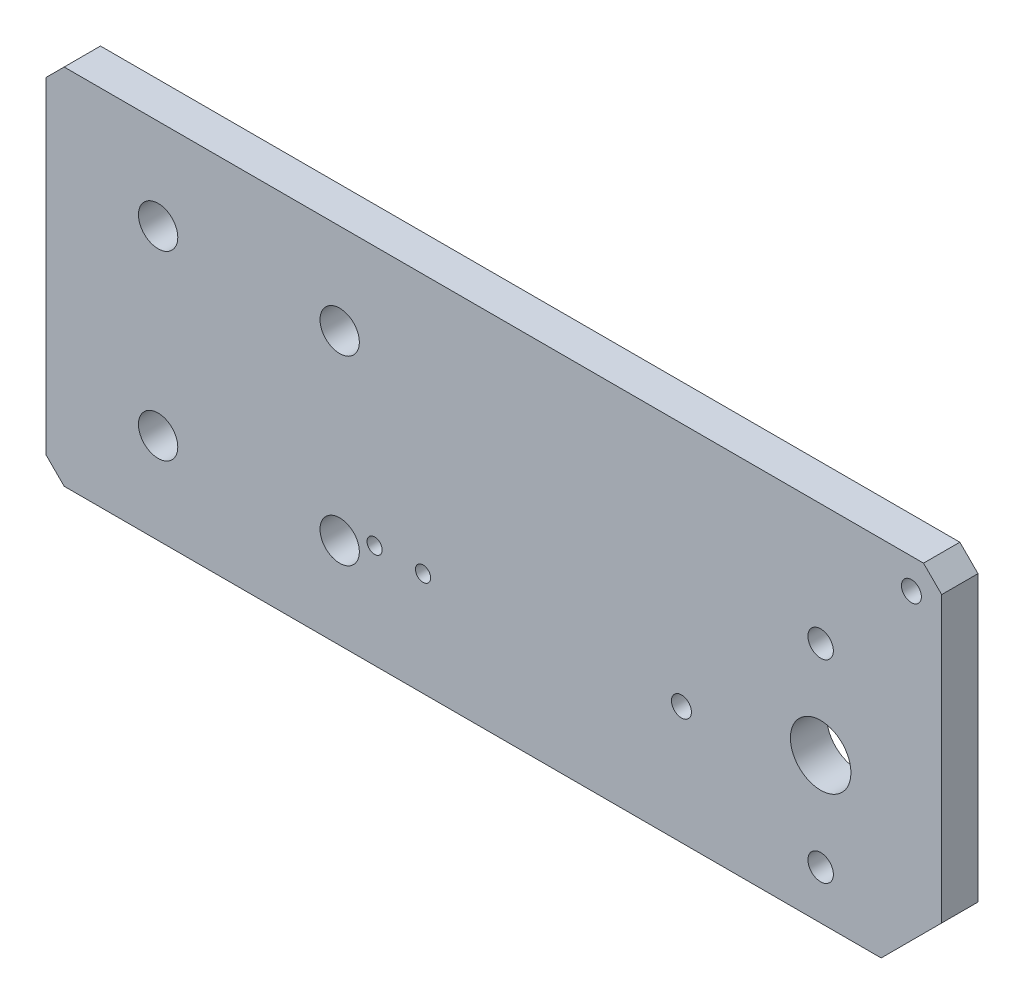
ISO-10303-21;
HEADER;
FILE_DESCRIPTION(('STEP AP214'),'2;1');
FILE_NAME('part.step','',(''),(''),'','','');
FILE_SCHEMA(('AUTOMOTIVE_DESIGN { 1 0 10303 214 1 1 1 1 }'));
ENDSEC;
DATA;
#1=APPLICATION_CONTEXT('core data for automotive mechanical design processes');
#2=APPLICATION_PROTOCOL_DEFINITION('international standard','automotive_design',2000,#1);
#3=PRODUCT_CONTEXT('',#1,'mechanical');
#4=PRODUCT('Part','Part','',(#3));
#5=PRODUCT_RELATED_PRODUCT_CATEGORY('part','',(#4));
#6=PRODUCT_DEFINITION_FORMATION('','',#4);
#7=PRODUCT_DEFINITION_CONTEXT('part definition',#1,'design');
#8=PRODUCT_DEFINITION('design','',#6,#7);
#9=PRODUCT_DEFINITION_SHAPE('','',#8);
#10=(LENGTH_UNIT() NAMED_UNIT(*) SI_UNIT(.MILLI.,.METRE.));
#11=(NAMED_UNIT(*) PLANE_ANGLE_UNIT() SI_UNIT($,.RADIAN.));
#12=(NAMED_UNIT(*) SI_UNIT($,.STERADIAN.) SOLID_ANGLE_UNIT());
#13=UNCERTAINTY_MEASURE_WITH_UNIT(LENGTH_MEASURE(1.E-05),#10,'distance_accuracy_value','');
#14=(GEOMETRIC_REPRESENTATION_CONTEXT(3) GLOBAL_UNCERTAINTY_ASSIGNED_CONTEXT((#13)) GLOBAL_UNIT_ASSIGNED_CONTEXT((#10,
#11,#12)) REPRESENTATION_CONTEXT('',''));
#15=CARTESIAN_POINT('',(0.,0.,0.));
#16=DIRECTION('',(0.,0.,1.));
#17=DIRECTION('',(1.,0.,0.));
#18=AXIS2_PLACEMENT_3D('',#15,#16,#17);
#19=CARTESIAN_POINT('',(0.,0.,6.));
#20=DIRECTION('',(0.,0.,1.));
#21=DIRECTION('',(1.,0.,0.));
#22=AXIS2_PLACEMENT_3D('',#19,#20,#21);
#23=PLANE('',#22);
#24=CARTESIAN_POINT('',(0.781223922114056,-15.4494436717663,6.));
#25=DIRECTION('',(0.,0.,1.));
#26=DIRECTION('',(1.,0.,0.));
#27=AXIS2_PLACEMENT_3D('',#24,#25,#26);
#28=CIRCLE('',#27,1.25);
#29=CARTESIAN_POINT('',(2.03122392211405,-15.4494436717663,6.));
#30=VERTEX_POINT('',#29);
#31=EDGE_CURVE('E232',#30,#30,#28,.T.);
#32=ORIENTED_EDGE('',*,*,#31,.F.);
#33=EDGE_LOOP('',(#32));
#34=FACE_BOUND('',#33,.T.);
#35=CARTESIAN_POINT('',(8.78122392211406,-15.4494436717663,6.));
#36=DIRECTION('',(0.,0.,1.));
#37=DIRECTION('',(1.,0.,0.));
#38=AXIS2_PLACEMENT_3D('',#35,#36,#37);
#39=CIRCLE('',#38,1.25);
#40=CARTESIAN_POINT('',(10.0312239221141,-15.4494436717663,6.));
#41=VERTEX_POINT('',#40);
#42=EDGE_CURVE('E226',#41,#41,#39,.T.);
#43=ORIENTED_EDGE('',*,*,#42,.F.);
#44=EDGE_LOOP('',(#43));
#45=FACE_BOUND('',#44,.T.);
#46=CARTESIAN_POINT('',(89.4812239221141,22.4005563282337,6.));
#47=DIRECTION('',(0.,0.,1.));
#48=DIRECTION('',(1.,0.,0.));
#49=AXIS2_PLACEMENT_3D('',#46,#47,#48);
#50=CIRCLE('',#49,1.65);
#51=CARTESIAN_POINT('',(91.131223922114,22.4005563282337,6.));
#52=VERTEX_POINT('',#51);
#53=EDGE_CURVE('E220',#52,#52,#50,.T.);
#54=ORIENTED_EDGE('',*,*,#53,.F.);
#55=EDGE_LOOP('',(#54));
#56=FACE_BOUND('',#55,.T.);
#57=CARTESIAN_POINT('',(51.4812239221141,-13.0994436717663,6.));
#58=DIRECTION('',(0.,0.,1.));
#59=DIRECTION('',(1.,0.,0.));
#60=AXIS2_PLACEMENT_3D('',#57,#58,#59);
#61=CIRCLE('',#60,1.65);
#62=CARTESIAN_POINT('',(53.1312239221141,-13.0994436717663,6.));
#63=VERTEX_POINT('',#62);
#64=EDGE_CURVE('E214',#63,#63,#61,.T.);
#65=ORIENTED_EDGE('',*,*,#64,.F.);
#66=EDGE_LOOP('',(#65));
#67=FACE_BOUND('',#66,.T.);
#68=CARTESIAN_POINT('',(74.4812239221141,7.40055632823366,6.));
#69=DIRECTION('',(0.,0.,1.));
#70=DIRECTION('',(1.,0.,0.));
#71=AXIS2_PLACEMENT_3D('',#68,#69,#70);
#72=CIRCLE('',#71,2.1);
#73=CARTESIAN_POINT('',(76.5812239221141,7.40055632823366,6.));
#74=VERTEX_POINT('',#73);
#75=EDGE_CURVE('E208',#74,#74,#72,.T.);
#76=ORIENTED_EDGE('',*,*,#75,.F.);
#77=EDGE_LOOP('',(#76));
#78=FACE_BOUND('',#77,.T.);
#79=CARTESIAN_POINT('',(74.4812239221141,-24.5994436717663,6.));
#80=DIRECTION('',(0.,0.,1.));
#81=DIRECTION('',(1.,0.,0.));
#82=AXIS2_PLACEMENT_3D('',#79,#80,#81);
#83=CIRCLE('',#82,2.1);
#84=CARTESIAN_POINT('',(76.5812239221141,-24.5994436717663,6.));
#85=VERTEX_POINT('',#84);
#86=EDGE_CURVE('E202',#85,#85,#83,.T.);
#87=ORIENTED_EDGE('',*,*,#86,.F.);
#88=EDGE_LOOP('',(#87));
#89=FACE_BOUND('',#88,.T.);
#90=CARTESIAN_POINT('',(-4.99304589707927,-17.5994436717663,6.));
#91=DIRECTION('',(0.,0.,1.));
#92=DIRECTION('',(1.,0.,0.));
#93=AXIS2_PLACEMENT_3D('',#90,#91,#92);
#94=CIRCLE('',#93,3.25);
#95=CARTESIAN_POINT('',(-1.74304589707927,-17.5994436717663,6.));
#96=VERTEX_POINT('',#95);
#97=EDGE_CURVE('E185',#96,#96,#94,.T.);
#98=ORIENTED_EDGE('',*,*,#97,.F.);
#99=EDGE_LOOP('',(#98));
#100=FACE_BOUND('',#99,.T.);
#101=CARTESIAN_POINT('',(-4.99304589707927,12.4005563282337,6.));
#102=DIRECTION('',(0.,0.,1.));
#103=DIRECTION('',(1.,0.,0.));
#104=AXIS2_PLACEMENT_3D('',#101,#102,#103);
#105=CIRCLE('',#104,3.25);
#106=CARTESIAN_POINT('',(-1.74304589707927,12.4005563282337,6.));
#107=VERTEX_POINT('',#106);
#108=EDGE_CURVE('E174',#107,#107,#105,.T.);
#109=ORIENTED_EDGE('',*,*,#108,.F.);
#110=EDGE_LOOP('',(#109));
#111=FACE_BOUND('',#110,.T.);
#112=DIRECTION('',(0.,1.,0.));
#113=VECTOR('',#112,1.);
#114=CARTESIAN_POINT('',(94.4812239221141,27.4005563282337,6.));
#115=LINE('',#114,#113);
#116=CARTESIAN_POINT('',(94.4812239221141,-22.5994436717663,6.));
#117=VERTEX_POINT('',#116);
#118=CARTESIAN_POINT('',(94.4812239221141,24.4005563282336,6.));
#119=VERTEX_POINT('',#118);
#120=EDGE_CURVE('E119',#117,#119,#115,.T.);
#121=ORIENTED_EDGE('',*,*,#120,.T.);
#122=DIRECTION('',(0.707106781186546,-0.707106781186549,0.));
#123=VECTOR('',#122,1.);
#124=CARTESIAN_POINT('',(59.4408901251741,59.4408901251738,6.));
#125=LINE('',#124,#123);
#126=CARTESIAN_POINT('',(91.4812239221141,27.4005563282337,6.));
#127=VERTEX_POINT('',#126);
#128=EDGE_CURVE('E154',#119,#127,#125,.F.);
#129=ORIENTED_EDGE('',*,*,#128,.T.);
#130=DIRECTION('',(-1.,0.,0.));
#131=VECTOR('',#130,1.);
#132=CARTESIAN_POINT('',(-53.5187760778859,27.4005563282337,6.));
#133=LINE('',#132,#131);
#134=CARTESIAN_POINT('',(-50.5187760778859,27.4005563282337,6.));
#135=VERTEX_POINT('',#134);
#136=EDGE_CURVE('E120',#127,#135,#133,.T.);
#137=ORIENTED_EDGE('',*,*,#136,.T.);
#138=DIRECTION('',(0.707106781186549,0.707106781186546,0.));
#139=VECTOR('',#138,1.);
#140=CARTESIAN_POINT('',(-38.9596662030597,38.9596662030599,6.));
#141=LINE('',#140,#139);
#142=CARTESIAN_POINT('',(-53.5187760778859,24.4005563282337,6.));
#143=VERTEX_POINT('',#142);
#144=EDGE_CURVE('E55',#135,#143,#141,.F.);
#145=ORIENTED_EDGE('',*,*,#144,.T.);
#146=DIRECTION('',(0.,-1.,0.));
#147=VECTOR('',#146,1.);
#148=CARTESIAN_POINT('',(-53.5187760778859,27.4005563282337,6.));
#149=LINE('',#148,#147);
#150=CARTESIAN_POINT('',(-53.5187760778859,-29.5994436717663,6.));
#151=VERTEX_POINT('',#150);
#152=EDGE_CURVE('E130',#143,#151,#149,.T.);
#153=ORIENTED_EDGE('',*,*,#152,.T.);
#154=DIRECTION('',(-0.707106781186548,0.707106781186548,0.));
#155=VECTOR('',#154,1.);
#156=CARTESIAN_POINT('',(-41.5591098748261,-41.5591098748261,6.));
#157=LINE('',#156,#155);
#158=CARTESIAN_POINT('',(-50.5187760778859,-32.5994436717663,6.));
#159=VERTEX_POINT('',#158);
#160=EDGE_CURVE('E152',#151,#159,#157,.F.);
#161=ORIENTED_EDGE('',*,*,#160,.T.);
#162=DIRECTION('',(1.,0.,0.));
#163=VECTOR('',#162,1.);
#164=CARTESIAN_POINT('',(-53.5187760778859,-32.5994436717663,6.));
#165=LINE('',#164,#163);
#166=CARTESIAN_POINT('',(84.481223922114,-32.5994436717663,6.));
#167=VERTEX_POINT('',#166);
#168=EDGE_CURVE('E170',#159,#167,#165,.T.);
#169=ORIENTED_EDGE('',*,*,#168,.T.);
#170=DIRECTION('',(-0.707106781186549,-0.707106781186546,0.));
#171=VECTOR('',#170,1.);
#172=CARTESIAN_POINT('',(58.54033379694,-58.5403337969403,6.));
#173=LINE('',#172,#171);
#174=EDGE_CURVE('E137',#167,#117,#173,.F.);
#175=ORIENTED_EDGE('',*,*,#174,.T.);
#176=EDGE_LOOP('',(#121,#129,#137,#145,#153,#161,#169,#175));
#177=FACE_BOUND('',#176,.T.);
#178=CARTESIAN_POINT('',(-34.9930458970793,12.4005563282337,6.));
#179=DIRECTION('',(0.,0.,1.));
#180=DIRECTION('',(1.,0.,0.));
#181=AXIS2_PLACEMENT_3D('',#178,#179,#180);
#182=CIRCLE('',#181,3.25);
#183=CARTESIAN_POINT('',(-31.7430458970793,12.4005563282337,6.));
#184=VERTEX_POINT('',#183);
#185=EDGE_CURVE('E163',#184,#184,#182,.T.);
#186=ORIENTED_EDGE('',*,*,#185,.F.);
#187=EDGE_LOOP('',(#186));
#188=FACE_BOUND('',#187,.T.);
#189=CARTESIAN_POINT('',(-34.9930458970793,-17.5994436717663,6.));
#190=DIRECTION('',(0.,0.,1.));
#191=DIRECTION('',(1.,0.,0.));
#192=AXIS2_PLACEMENT_3D('',#189,#190,#191);
#193=CIRCLE('',#192,3.25);
#194=CARTESIAN_POINT('',(-31.7430458970793,-17.5994436717663,6.));
#195=VERTEX_POINT('',#194);
#196=EDGE_CURVE('E179',#195,#195,#193,.T.);
#197=ORIENTED_EDGE('',*,*,#196,.F.);
#198=EDGE_LOOP('',(#197));
#199=FACE_BOUND('',#198,.T.);
#200=CARTESIAN_POINT('',(74.4812239221141,-8.59944367176634,6.));
#201=DIRECTION('',(0.,0.,1.));
#202=DIRECTION('',(1.,0.,0.));
#203=AXIS2_PLACEMENT_3D('',#200,#201,#202);
#204=CIRCLE('',#203,5.);
#205=CARTESIAN_POINT('',(79.4812239221141,-8.59944367176634,6.));
#206=VERTEX_POINT('',#205);
#207=EDGE_CURVE('E191',#206,#206,#204,.T.);
#208=ORIENTED_EDGE('',*,*,#207,.F.);
#209=EDGE_LOOP('',(#208));
#210=FACE_BOUND('',#209,.T.);
#211=ADVANCED_FACE('F35',(#34,#45,#56,#67,#78,#89,#100,#111,#177,#188,#199,#210),#23,.T.);
#212=CARTESIAN_POINT('',(0.,0.,0.));
#213=DIRECTION('',(0.,0.,1.));
#214=DIRECTION('',(1.,0.,0.));
#215=AXIS2_PLACEMENT_3D('',#212,#213,#214);
#216=PLANE('',#215);
#217=CARTESIAN_POINT('',(0.781223922114056,-15.4494436717663,0.));
#218=DIRECTION('',(0.,0.,1.));
#219=DIRECTION('',(1.,0.,0.));
#220=AXIS2_PLACEMENT_3D('',#217,#218,#219);
#221=CIRCLE('',#220,1.25);
#222=CARTESIAN_POINT('',(2.03122392211405,-15.4494436717663,0.));
#223=VERTEX_POINT('',#222);
#224=EDGE_CURVE('E229',#223,#223,#221,.T.);
#225=ORIENTED_EDGE('',*,*,#224,.T.);
#226=EDGE_LOOP('',(#225));
#227=FACE_BOUND('',#226,.T.);
#228=CARTESIAN_POINT('',(8.78122392211406,-15.4494436717663,0.));
#229=DIRECTION('',(0.,0.,1.));
#230=DIRECTION('',(1.,0.,0.));
#231=AXIS2_PLACEMENT_3D('',#228,#229,#230);
#232=CIRCLE('',#231,1.25);
#233=CARTESIAN_POINT('',(10.0312239221141,-15.4494436717663,0.));
#234=VERTEX_POINT('',#233);
#235=EDGE_CURVE('E223',#234,#234,#232,.T.);
#236=ORIENTED_EDGE('',*,*,#235,.T.);
#237=EDGE_LOOP('',(#236));
#238=FACE_BOUND('',#237,.T.);
#239=CARTESIAN_POINT('',(89.4812239221141,22.4005563282337,0.));
#240=DIRECTION('',(0.,0.,1.));
#241=DIRECTION('',(1.,0.,0.));
#242=AXIS2_PLACEMENT_3D('',#239,#240,#241);
#243=CIRCLE('',#242,1.65);
#244=CARTESIAN_POINT('',(91.131223922114,22.4005563282337,0.));
#245=VERTEX_POINT('',#244);
#246=EDGE_CURVE('E217',#245,#245,#243,.T.);
#247=ORIENTED_EDGE('',*,*,#246,.T.);
#248=EDGE_LOOP('',(#247));
#249=FACE_BOUND('',#248,.T.);
#250=CARTESIAN_POINT('',(51.4812239221141,-13.0994436717663,0.));
#251=DIRECTION('',(0.,0.,1.));
#252=DIRECTION('',(1.,0.,0.));
#253=AXIS2_PLACEMENT_3D('',#250,#251,#252);
#254=CIRCLE('',#253,1.65);
#255=CARTESIAN_POINT('',(53.1312239221141,-13.0994436717663,0.));
#256=VERTEX_POINT('',#255);
#257=EDGE_CURVE('E211',#256,#256,#254,.T.);
#258=ORIENTED_EDGE('',*,*,#257,.T.);
#259=EDGE_LOOP('',(#258));
#260=FACE_BOUND('',#259,.T.);
#261=CARTESIAN_POINT('',(74.4812239221141,7.40055632823366,0.));
#262=DIRECTION('',(0.,0.,1.));
#263=DIRECTION('',(1.,0.,0.));
#264=AXIS2_PLACEMENT_3D('',#261,#262,#263);
#265=CIRCLE('',#264,2.1);
#266=CARTESIAN_POINT('',(76.5812239221141,7.40055632823366,0.));
#267=VERTEX_POINT('',#266);
#268=EDGE_CURVE('E205',#267,#267,#265,.T.);
#269=ORIENTED_EDGE('',*,*,#268,.T.);
#270=EDGE_LOOP('',(#269));
#271=FACE_BOUND('',#270,.T.);
#272=CARTESIAN_POINT('',(74.4812239221141,-24.5994436717663,0.));
#273=DIRECTION('',(0.,0.,1.));
#274=DIRECTION('',(1.,0.,0.));
#275=AXIS2_PLACEMENT_3D('',#272,#273,#274);
#276=CIRCLE('',#275,2.1);
#277=CARTESIAN_POINT('',(76.5812239221141,-24.5994436717663,0.));
#278=VERTEX_POINT('',#277);
#279=EDGE_CURVE('E197',#278,#278,#276,.T.);
#280=ORIENTED_EDGE('',*,*,#279,.T.);
#281=EDGE_LOOP('',(#280));
#282=FACE_BOUND('',#281,.T.);
#283=DIRECTION('',(-1.,0.,0.));
#284=VECTOR('',#283,1.);
#285=CARTESIAN_POINT('',(-53.5187760778859,27.4005563282337,0.));
#286=LINE('',#285,#284);
#287=CARTESIAN_POINT('',(91.4812239221141,27.4005563282337,0.));
#288=VERTEX_POINT('',#287);
#289=CARTESIAN_POINT('',(-50.5187760778859,27.4005563282337,0.));
#290=VERTEX_POINT('',#289);
#291=EDGE_CURVE('E126',#288,#290,#286,.T.);
#292=ORIENTED_EDGE('',*,*,#291,.F.);
#293=DIRECTION('',(-0.707106781186546,0.707106781186549,0.));
#294=VECTOR('',#293,1.);
#295=CARTESIAN_POINT('',(91.4812239221141,27.4005563282337,0.));
#296=LINE('',#295,#294);
#297=CARTESIAN_POINT('',(94.4812239221141,24.4005563282336,0.));
#298=VERTEX_POINT('',#297);
#299=EDGE_CURVE('E125',#288,#298,#296,.F.);
#300=ORIENTED_EDGE('',*,*,#299,.T.);
#301=DIRECTION('',(0.,1.,0.));
#302=VECTOR('',#301,1.);
#303=CARTESIAN_POINT('',(94.4812239221141,27.4005563282337,0.));
#304=LINE('',#303,#302);
#305=CARTESIAN_POINT('',(94.4812239221141,-22.5994436717663,0.));
#306=VERTEX_POINT('',#305);
#307=EDGE_CURVE('E116',#306,#298,#304,.T.);
#308=ORIENTED_EDGE('',*,*,#307,.F.);
#309=DIRECTION('',(0.707106781186549,0.707106781186546,0.));
#310=VECTOR('',#309,1.);
#311=CARTESIAN_POINT('',(94.4812239221141,-22.5994436717663,0.));
#312=LINE('',#311,#310);
#313=CARTESIAN_POINT('',(84.481223922114,-32.5994436717663,0.));
#314=VERTEX_POINT('',#313);
#315=EDGE_CURVE('E101',#306,#314,#312,.F.);
#316=ORIENTED_EDGE('',*,*,#315,.T.);
#317=DIRECTION('',(1.,0.,0.));
#318=VECTOR('',#317,1.);
#319=CARTESIAN_POINT('',(-53.5187760778859,-32.5994436717663,0.));
#320=LINE('',#319,#318);
#321=CARTESIAN_POINT('',(-50.5187760778859,-32.5994436717663,0.));
#322=VERTEX_POINT('',#321);
#323=EDGE_CURVE('E127',#322,#314,#320,.T.);
#324=ORIENTED_EDGE('',*,*,#323,.F.);
#325=DIRECTION('',(0.707106781186548,-0.707106781186548,0.));
#326=VECTOR('',#325,1.);
#327=CARTESIAN_POINT('',(-50.5187760778859,-32.5994436717663,0.));
#328=LINE('',#327,#326);
#329=CARTESIAN_POINT('',(-53.5187760778859,-29.5994436717663,0.));
#330=VERTEX_POINT('',#329);
#331=EDGE_CURVE('E146',#322,#330,#328,.F.);
#332=ORIENTED_EDGE('',*,*,#331,.T.);
#333=DIRECTION('',(0.,-1.,0.));
#334=VECTOR('',#333,1.);
#335=CARTESIAN_POINT('',(-53.5187760778859,27.4005563282337,0.));
#336=LINE('',#335,#334);
#337=CARTESIAN_POINT('',(-53.5187760778859,24.4005563282337,0.));
#338=VERTEX_POINT('',#337);
#339=EDGE_CURVE('E132',#338,#330,#336,.T.);
#340=ORIENTED_EDGE('',*,*,#339,.F.);
#341=DIRECTION('',(-0.707106781186549,-0.707106781186546,0.));
#342=VECTOR('',#341,1.);
#343=CARTESIAN_POINT('',(-53.5187760778859,24.4005563282337,0.));
#344=LINE('',#343,#342);
#345=EDGE_CURVE('E144',#338,#290,#344,.F.);
#346=ORIENTED_EDGE('',*,*,#345,.T.);
#347=EDGE_LOOP('',(#292,#300,#308,#316,#324,#332,#340,#346));
#348=FACE_BOUND('',#347,.T.);
#349=CARTESIAN_POINT('',(-34.9930458970793,12.4005563282337,0.));
#350=DIRECTION('',(0.,0.,1.));
#351=DIRECTION('',(1.,0.,0.));
#352=AXIS2_PLACEMENT_3D('',#349,#350,#351);
#353=CIRCLE('',#352,3.25);
#354=CARTESIAN_POINT('',(-31.7430458970793,12.4005563282337,0.));
#355=VERTEX_POINT('',#354);
#356=EDGE_CURVE('E165',#355,#355,#353,.T.);
#357=ORIENTED_EDGE('',*,*,#356,.T.);
#358=EDGE_LOOP('',(#357));
#359=FACE_BOUND('',#358,.T.);
#360=CARTESIAN_POINT('',(-4.99304589707927,12.4005563282337,0.));
#361=DIRECTION('',(0.,0.,1.));
#362=DIRECTION('',(1.,0.,0.));
#363=AXIS2_PLACEMENT_3D('',#360,#361,#362);
#364=CIRCLE('',#363,3.25);
#365=CARTESIAN_POINT('',(-1.74304589707927,12.4005563282337,0.));
#366=VERTEX_POINT('',#365);
#367=EDGE_CURVE('E176',#366,#366,#364,.T.);
#368=ORIENTED_EDGE('',*,*,#367,.T.);
#369=EDGE_LOOP('',(#368));
#370=FACE_BOUND('',#369,.T.);
#371=CARTESIAN_POINT('',(-34.9930458970793,-17.5994436717663,0.));
#372=DIRECTION('',(0.,0.,1.));
#373=DIRECTION('',(1.,0.,0.));
#374=AXIS2_PLACEMENT_3D('',#371,#372,#373);
#375=CIRCLE('',#374,3.25);
#376=CARTESIAN_POINT('',(-31.7430458970793,-17.5994436717663,0.));
#377=VERTEX_POINT('',#376);
#378=EDGE_CURVE('E182',#377,#377,#375,.T.);
#379=ORIENTED_EDGE('',*,*,#378,.T.);
#380=EDGE_LOOP('',(#379));
#381=FACE_BOUND('',#380,.T.);
#382=CARTESIAN_POINT('',(-4.99304589707927,-17.5994436717663,0.));
#383=DIRECTION('',(0.,0.,1.));
#384=DIRECTION('',(1.,0.,0.));
#385=AXIS2_PLACEMENT_3D('',#382,#383,#384);
#386=CIRCLE('',#385,3.25);
#387=CARTESIAN_POINT('',(-1.74304589707927,-17.5994436717663,0.));
#388=VERTEX_POINT('',#387);
#389=EDGE_CURVE('E188',#388,#388,#386,.T.);
#390=ORIENTED_EDGE('',*,*,#389,.T.);
#391=EDGE_LOOP('',(#390));
#392=FACE_BOUND('',#391,.T.);
#393=CARTESIAN_POINT('',(74.4812239221141,-8.59944367176634,0.));
#394=DIRECTION('',(0.,0.,1.));
#395=DIRECTION('',(1.,0.,0.));
#396=AXIS2_PLACEMENT_3D('',#393,#394,#395);
#397=CIRCLE('',#396,5.);
#398=CARTESIAN_POINT('',(79.4812239221141,-8.59944367176634,0.));
#399=VERTEX_POINT('',#398);
#400=EDGE_CURVE('E194',#399,#399,#397,.T.);
#401=ORIENTED_EDGE('',*,*,#400,.T.);
#402=EDGE_LOOP('',(#401));
#403=FACE_BOUND('',#402,.T.);
#404=ADVANCED_FACE('F123',(#227,#238,#249,#260,#271,#282,#348,#359,#370,#381,#392,#403),#216,.F.);
#405=CARTESIAN_POINT('',(-53.5187760778859,27.4005563282337,6.));
#406=DIRECTION('',(1.,0.,0.));
#407=DIRECTION('',(0.,1.,0.));
#408=AXIS2_PLACEMENT_3D('',#405,#406,#407);
#409=PLANE('',#408);
#410=ORIENTED_EDGE('',*,*,#339,.T.);
#411=DIRECTION('',(0.,0.,1.));
#412=VECTOR('',#411,1.);
#413=CARTESIAN_POINT('',(-53.5187760778859,-29.5994436717663,6.));
#414=LINE('',#413,#412);
#415=EDGE_CURVE('E11',#330,#151,#414,.T.);
#416=ORIENTED_EDGE('',*,*,#415,.T.);
#417=ORIENTED_EDGE('',*,*,#152,.F.);
#418=DIRECTION('',(0.,0.,-1.));
#419=VECTOR('',#418,1.);
#420=CARTESIAN_POINT('',(-53.5187760778859,24.4005563282337,6.));
#421=LINE('',#420,#419);
#422=EDGE_CURVE('E43',#143,#338,#421,.T.);
#423=ORIENTED_EDGE('',*,*,#422,.T.);
#424=EDGE_LOOP('',(#410,#416,#417,#423));
#425=FACE_BOUND('',#424,.T.);
#426=ADVANCED_FACE('F161',(#425),#409,.F.);
#427=CARTESIAN_POINT('',(-53.5187760778859,-32.5994436717663,6.));
#428=DIRECTION('',(0.,1.,0.));
#429=DIRECTION('',(0.,0.,1.));
#430=AXIS2_PLACEMENT_3D('',#427,#428,#429);
#431=PLANE('',#430);
#432=ORIENTED_EDGE('',*,*,#168,.F.);
#433=DIRECTION('',(0.,0.,-1.));
#434=VECTOR('',#433,1.);
#435=CARTESIAN_POINT('',(-50.5187760778859,-32.5994436717663,6.));
#436=LINE('',#435,#434);
#437=EDGE_CURVE('E156',#159,#322,#436,.T.);
#438=ORIENTED_EDGE('',*,*,#437,.T.);
#439=ORIENTED_EDGE('',*,*,#323,.T.);
#440=DIRECTION('',(0.,0.,1.));
#441=VECTOR('',#440,1.);
#442=CARTESIAN_POINT('',(84.481223922114,-32.5994436717663,6.));
#443=LINE('',#442,#441);
#444=EDGE_CURVE('E107',#314,#167,#443,.T.);
#445=ORIENTED_EDGE('',*,*,#444,.T.);
#446=EDGE_LOOP('',(#432,#438,#439,#445));
#447=FACE_BOUND('',#446,.T.);
#448=ADVANCED_FACE('F276',(#447),#431,.F.);
#449=CARTESIAN_POINT('',(94.4812239221141,27.4005563282337,6.));
#450=DIRECTION('',(-1.,0.,0.));
#451=DIRECTION('',(0.,-1.,0.));
#452=AXIS2_PLACEMENT_3D('',#449,#450,#451);
#453=PLANE('',#452);
#454=ORIENTED_EDGE('',*,*,#307,.T.);
#455=DIRECTION('',(0.,0.,1.));
#456=VECTOR('',#455,1.);
#457=CARTESIAN_POINT('',(94.4812239221141,24.4005563282336,6.));
#458=LINE('',#457,#456);
#459=EDGE_CURVE('E149',#298,#119,#458,.T.);
#460=ORIENTED_EDGE('',*,*,#459,.T.);
#461=ORIENTED_EDGE('',*,*,#120,.F.);
#462=DIRECTION('',(0.,0.,-1.));
#463=VECTOR('',#462,1.);
#464=CARTESIAN_POINT('',(94.4812239221141,-22.5994436717663,6.));
#465=LINE('',#464,#463);
#466=EDGE_CURVE('E105',#117,#306,#465,.T.);
#467=ORIENTED_EDGE('',*,*,#466,.T.);
#468=EDGE_LOOP('',(#454,#460,#461,#467));
#469=FACE_BOUND('',#468,.T.);
#470=ADVANCED_FACE('F115',(#469),#453,.F.);
#471=CARTESIAN_POINT('',(-53.5187760778859,27.4005563282337,6.));
#472=DIRECTION('',(0.,-1.,0.));
#473=DIRECTION('',(1.,0.,0.));
#474=AXIS2_PLACEMENT_3D('',#471,#472,#473);
#475=PLANE('',#474);
#476=ORIENTED_EDGE('',*,*,#136,.F.);
#477=DIRECTION('',(0.,0.,-1.));
#478=VECTOR('',#477,1.);
#479=CARTESIAN_POINT('',(91.4812239221141,27.4005563282337,6.));
#480=LINE('',#479,#478);
#481=EDGE_CURVE('E141',#127,#288,#480,.T.);
#482=ORIENTED_EDGE('',*,*,#481,.T.);
#483=ORIENTED_EDGE('',*,*,#291,.T.);
#484=DIRECTION('',(0.,0.,1.));
#485=VECTOR('',#484,1.);
#486=CARTESIAN_POINT('',(-50.5187760778859,27.4005563282337,6.));
#487=LINE('',#486,#485);
#488=EDGE_CURVE('E139',#290,#135,#487,.T.);
#489=ORIENTED_EDGE('',*,*,#488,.T.);
#490=EDGE_LOOP('',(#476,#482,#483,#489));
#491=FACE_BOUND('',#490,.T.);
#492=ADVANCED_FACE('F281',(#491),#475,.F.);
#493=CARTESIAN_POINT('',(-34.9930458970793,12.4005563282337,6.));
#494=DIRECTION('',(0.,0.,-1.));
#495=DIRECTION('',(-1.,0.,0.));
#496=AXIS2_PLACEMENT_3D('',#493,#494,#495);
#497=CYLINDRICAL_SURFACE('',#496,3.25);
#498=ORIENTED_EDGE('',*,*,#185,.T.);
#499=EDGE_LOOP('',(#498));
#500=FACE_BOUND('',#499,.T.);
#501=ORIENTED_EDGE('',*,*,#356,.F.);
#502=EDGE_LOOP('',(#501));
#503=FACE_BOUND('',#502,.T.);
#504=ADVANCED_FACE('F284',(#500,#503),#497,.F.);
#505=CARTESIAN_POINT('',(-4.99304589707927,12.4005563282337,6.));
#506=DIRECTION('',(0.,0.,-1.));
#507=DIRECTION('',(-1.,0.,0.));
#508=AXIS2_PLACEMENT_3D('',#505,#506,#507);
#509=CYLINDRICAL_SURFACE('',#508,3.25);
#510=ORIENTED_EDGE('',*,*,#108,.T.);
#511=EDGE_LOOP('',(#510));
#512=FACE_BOUND('',#511,.T.);
#513=ORIENTED_EDGE('',*,*,#367,.F.);
#514=EDGE_LOOP('',(#513));
#515=FACE_BOUND('',#514,.T.);
#516=ADVANCED_FACE('F451',(#512,#515),#509,.F.);
#517=CARTESIAN_POINT('',(-34.9930458970793,-17.5994436717663,6.));
#518=DIRECTION('',(0.,0.,-1.));
#519=DIRECTION('',(-1.,0.,0.));
#520=AXIS2_PLACEMENT_3D('',#517,#518,#519);
#521=CYLINDRICAL_SURFACE('',#520,3.25);
#522=ORIENTED_EDGE('',*,*,#196,.T.);
#523=EDGE_LOOP('',(#522));
#524=FACE_BOUND('',#523,.T.);
#525=ORIENTED_EDGE('',*,*,#378,.F.);
#526=EDGE_LOOP('',(#525));
#527=FACE_BOUND('',#526,.T.);
#528=ADVANCED_FACE('F441',(#524,#527),#521,.F.);
#529=CARTESIAN_POINT('',(-4.99304589707927,-17.5994436717663,6.));
#530=DIRECTION('',(0.,0.,-1.));
#531=DIRECTION('',(-1.,0.,0.));
#532=AXIS2_PLACEMENT_3D('',#529,#530,#531);
#533=CYLINDRICAL_SURFACE('',#532,3.25);
#534=ORIENTED_EDGE('',*,*,#97,.T.);
#535=EDGE_LOOP('',(#534));
#536=FACE_BOUND('',#535,.T.);
#537=ORIENTED_EDGE('',*,*,#389,.F.);
#538=EDGE_LOOP('',(#537));
#539=FACE_BOUND('',#538,.T.);
#540=ADVANCED_FACE('F266',(#536,#539),#533,.F.);
#541=CARTESIAN_POINT('',(74.4812239221141,-8.59944367176634,6.));
#542=DIRECTION('',(0.,0.,-1.));
#543=DIRECTION('',(-1.,0.,0.));
#544=AXIS2_PLACEMENT_3D('',#541,#542,#543);
#545=CYLINDRICAL_SURFACE('',#544,5.);
#546=ORIENTED_EDGE('',*,*,#207,.T.);
#547=EDGE_LOOP('',(#546));
#548=FACE_BOUND('',#547,.T.);
#549=ORIENTED_EDGE('',*,*,#400,.F.);
#550=EDGE_LOOP('',(#549));
#551=FACE_BOUND('',#550,.T.);
#552=ADVANCED_FACE('F262',(#548,#551),#545,.F.);
#553=CARTESIAN_POINT('',(74.4812239221141,-24.5994436717663,6.));
#554=DIRECTION('',(0.,0.,1.));
#555=DIRECTION('',(1.,0.,0.));
#556=AXIS2_PLACEMENT_3D('',#553,#554,#555);
#557=CYLINDRICAL_SURFACE('',#556,2.1);
#558=ORIENTED_EDGE('',*,*,#279,.F.);
#559=EDGE_LOOP('',(#558));
#560=FACE_BOUND('',#559,.T.);
#561=ORIENTED_EDGE('',*,*,#86,.T.);
#562=EDGE_LOOP('',(#561));
#563=FACE_BOUND('',#562,.T.);
#564=ADVANCED_FACE('F265',(#560,#563),#557,.F.);
#565=CARTESIAN_POINT('',(74.4812239221141,7.40055632823366,6.));
#566=DIRECTION('',(0.,0.,1.));
#567=DIRECTION('',(1.,0.,0.));
#568=AXIS2_PLACEMENT_3D('',#565,#566,#567);
#569=CYLINDRICAL_SURFACE('',#568,2.1);
#570=ORIENTED_EDGE('',*,*,#268,.F.);
#571=EDGE_LOOP('',(#570));
#572=FACE_BOUND('',#571,.T.);
#573=ORIENTED_EDGE('',*,*,#75,.T.);
#574=EDGE_LOOP('',(#573));
#575=FACE_BOUND('',#574,.T.);
#576=ADVANCED_FACE('F406',(#572,#575),#569,.F.);
#577=CARTESIAN_POINT('',(51.4812239221141,-13.0994436717663,6.));
#578=DIRECTION('',(0.,0.,1.));
#579=DIRECTION('',(1.,0.,0.));
#580=AXIS2_PLACEMENT_3D('',#577,#578,#579);
#581=CYLINDRICAL_SURFACE('',#580,1.65);
#582=ORIENTED_EDGE('',*,*,#257,.F.);
#583=EDGE_LOOP('',(#582));
#584=FACE_BOUND('',#583,.T.);
#585=ORIENTED_EDGE('',*,*,#64,.T.);
#586=EDGE_LOOP('',(#585));
#587=FACE_BOUND('',#586,.T.);
#588=ADVANCED_FACE('F395',(#584,#587),#581,.F.);
#589=CARTESIAN_POINT('',(89.4812239221141,22.4005563282337,6.));
#590=DIRECTION('',(0.,0.,1.));
#591=DIRECTION('',(1.,0.,0.));
#592=AXIS2_PLACEMENT_3D('',#589,#590,#591);
#593=CYLINDRICAL_SURFACE('',#592,1.65);
#594=ORIENTED_EDGE('',*,*,#246,.F.);
#595=EDGE_LOOP('',(#594));
#596=FACE_BOUND('',#595,.T.);
#597=ORIENTED_EDGE('',*,*,#53,.T.);
#598=EDGE_LOOP('',(#597));
#599=FACE_BOUND('',#598,.T.);
#600=ADVANCED_FACE('F384',(#596,#599),#593,.F.);
#601=CARTESIAN_POINT('',(8.78122392211406,-15.4494436717663,6.));
#602=DIRECTION('',(0.,0.,1.));
#603=DIRECTION('',(1.,0.,0.));
#604=AXIS2_PLACEMENT_3D('',#601,#602,#603);
#605=CYLINDRICAL_SURFACE('',#604,1.25);
#606=ORIENTED_EDGE('',*,*,#235,.F.);
#607=EDGE_LOOP('',(#606));
#608=FACE_BOUND('',#607,.T.);
#609=ORIENTED_EDGE('',*,*,#42,.T.);
#610=EDGE_LOOP('',(#609));
#611=FACE_BOUND('',#610,.T.);
#612=ADVANCED_FACE('F372',(#608,#611),#605,.F.);
#613=CARTESIAN_POINT('',(0.781223922114056,-15.4494436717663,6.));
#614=DIRECTION('',(0.,0.,1.));
#615=DIRECTION('',(1.,0.,0.));
#616=AXIS2_PLACEMENT_3D('',#613,#614,#615);
#617=CYLINDRICAL_SURFACE('',#616,1.25);
#618=ORIENTED_EDGE('',*,*,#224,.F.);
#619=EDGE_LOOP('',(#618));
#620=FACE_BOUND('',#619,.T.);
#621=ORIENTED_EDGE('',*,*,#31,.T.);
#622=EDGE_LOOP('',(#621));
#623=FACE_BOUND('',#622,.T.);
#624=ADVANCED_FACE('F236',(#620,#623),#617,.F.);
#625=CARTESIAN_POINT('',(94.4812239221141,-22.5994436717663,6.));
#626=DIRECTION('',(-0.707106781186546,0.707106781186549,0.));
#627=DIRECTION('',(0.,0.,-1.));
#628=AXIS2_PLACEMENT_3D('',#625,#626,#627);
#629=PLANE('',#628);
#630=ORIENTED_EDGE('',*,*,#174,.F.);
#631=ORIENTED_EDGE('',*,*,#444,.F.);
#632=ORIENTED_EDGE('',*,*,#315,.F.);
#633=ORIENTED_EDGE('',*,*,#466,.F.);
#634=EDGE_LOOP('',(#630,#631,#632,#633));
#635=FACE_BOUND('',#634,.T.);
#636=ADVANCED_FACE('F104',(#635),#629,.F.);
#637=CARTESIAN_POINT('',(91.4812239221141,27.4005563282337,6.));
#638=DIRECTION('',(-0.707106781186549,-0.707106781186546,0.));
#639=DIRECTION('',(0.,0.,-1.));
#640=AXIS2_PLACEMENT_3D('',#637,#638,#639);
#641=PLANE('',#640);
#642=ORIENTED_EDGE('',*,*,#128,.F.);
#643=ORIENTED_EDGE('',*,*,#459,.F.);
#644=ORIENTED_EDGE('',*,*,#299,.F.);
#645=ORIENTED_EDGE('',*,*,#481,.F.);
#646=EDGE_LOOP('',(#642,#643,#644,#645));
#647=FACE_BOUND('',#646,.T.);
#648=ADVANCED_FACE('F293',(#647),#641,.F.);
#649=CARTESIAN_POINT('',(-50.5187760778859,-32.5994436717663,6.));
#650=DIRECTION('',(0.707106781186547,0.707106781186547,0.));
#651=DIRECTION('',(0.,0.,-1.));
#652=AXIS2_PLACEMENT_3D('',#649,#650,#651);
#653=PLANE('',#652);
#654=ORIENTED_EDGE('',*,*,#160,.F.);
#655=ORIENTED_EDGE('',*,*,#415,.F.);
#656=ORIENTED_EDGE('',*,*,#331,.F.);
#657=ORIENTED_EDGE('',*,*,#437,.F.);
#658=EDGE_LOOP('',(#654,#655,#656,#657));
#659=FACE_BOUND('',#658,.T.);
#660=ADVANCED_FACE('F295',(#659),#653,.F.);
#661=CARTESIAN_POINT('',(-53.5187760778859,24.4005563282337,6.));
#662=DIRECTION('',(0.707106781186546,-0.707106781186549,0.));
#663=DIRECTION('',(0.,0.,-1.));
#664=AXIS2_PLACEMENT_3D('',#661,#662,#663);
#665=PLANE('',#664);
#666=ORIENTED_EDGE('',*,*,#144,.F.);
#667=ORIENTED_EDGE('',*,*,#488,.F.);
#668=ORIENTED_EDGE('',*,*,#345,.F.);
#669=ORIENTED_EDGE('',*,*,#422,.F.);
#670=EDGE_LOOP('',(#666,#667,#668,#669));
#671=FACE_BOUND('',#670,.T.);
#672=ADVANCED_FACE('F37',(#671),#665,.F.);
#673=CLOSED_SHELL('',(#211,#404,#426,#448,#470,#492,#504,#516,#528,#540,#552,#564,#576,#588,
#600,#612,#624,#636,#648,#660,#672));
#674=MANIFOLD_SOLID_BREP('B2',#673);
#675=ADVANCED_BREP_SHAPE_REPRESENTATION('',(#18,#674),#14);
#676=SHAPE_DEFINITION_REPRESENTATION(#9,#675);
ENDSEC;
END-ISO-10303-21;
